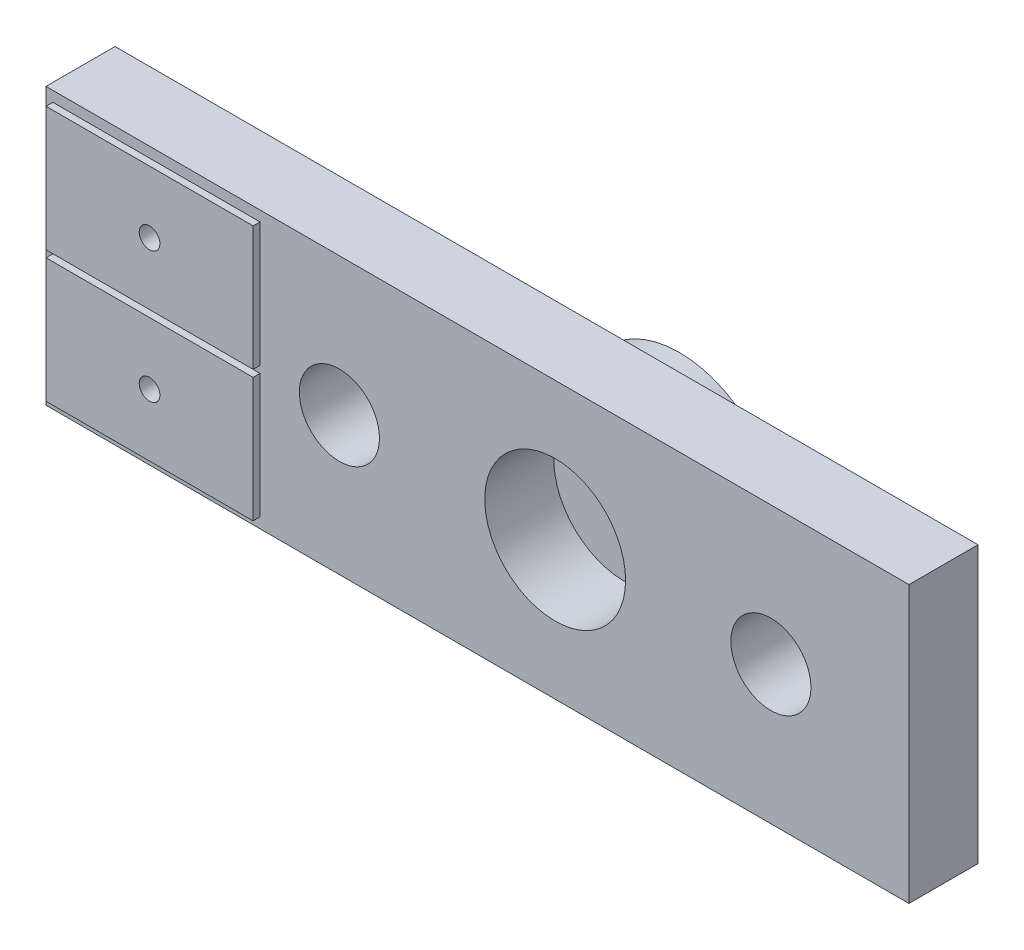
ISO-10303-21;
HEADER;
FILE_DESCRIPTION(('STEP AP214'),'2;1');
FILE_NAME('part.step','',(''),(''),'','','');
FILE_SCHEMA(('AUTOMOTIVE_DESIGN { 1 0 10303 214 1 1 1 1 }'));
ENDSEC;
DATA;
#1=APPLICATION_CONTEXT('core data for automotive mechanical design processes');
#2=APPLICATION_PROTOCOL_DEFINITION('international standard','automotive_design',2000,#1);
#3=PRODUCT_CONTEXT('',#1,'mechanical');
#4=PRODUCT('Part','Part','',(#3));
#5=PRODUCT_RELATED_PRODUCT_CATEGORY('part','',(#4));
#6=PRODUCT_DEFINITION_FORMATION('','',#4);
#7=PRODUCT_DEFINITION_CONTEXT('part definition',#1,'design');
#8=PRODUCT_DEFINITION('design','',#6,#7);
#9=PRODUCT_DEFINITION_SHAPE('','',#8);
#10=(LENGTH_UNIT() NAMED_UNIT(*) SI_UNIT(.MILLI.,.METRE.));
#11=(NAMED_UNIT(*) PLANE_ANGLE_UNIT() SI_UNIT($,.RADIAN.));
#12=(NAMED_UNIT(*) SI_UNIT($,.STERADIAN.) SOLID_ANGLE_UNIT());
#13=UNCERTAINTY_MEASURE_WITH_UNIT(LENGTH_MEASURE(1.E-05),#10,'distance_accuracy_value','');
#14=(GEOMETRIC_REPRESENTATION_CONTEXT(3) GLOBAL_UNCERTAINTY_ASSIGNED_CONTEXT((#13)) GLOBAL_UNIT_ASSIGNED_CONTEXT((#10,
#11,#12)) REPRESENTATION_CONTEXT('',''));
#15=CARTESIAN_POINT('',(0.,0.,0.));
#16=DIRECTION('',(0.,0.,1.));
#17=DIRECTION('',(1.,0.,0.));
#18=AXIS2_PLACEMENT_3D('',#15,#16,#17);
#19=CARTESIAN_POINT('',(0.,0.,2.54));
#20=DIRECTION('',(0.,0.,1.));
#21=DIRECTION('',(1.,0.,0.));
#22=AXIS2_PLACEMENT_3D('',#19,#20,#21);
#23=PLANE('',#22);
#24=CARTESIAN_POINT('',(2.47650000000001,0.,2.54));
#25=DIRECTION('',(0.,0.,1.));
#26=DIRECTION('',(1.,0.,0.));
#27=AXIS2_PLACEMENT_3D('',#24,#25,#26);
#28=CIRCLE('',#27,2.5908);
#29=CARTESIAN_POINT('',(5.06730000000001,0.,2.54));
#30=VERTEX_POINT('',#29);
#31=EDGE_CURVE('E201',#30,#30,#28,.T.);
#32=ORIENTED_EDGE('',*,*,#31,.F.);
#33=EDGE_LOOP('',(#32));
#34=FACE_BOUND('',#33,.T.);
#35=CARTESIAN_POINT('',(-5.461,0.,2.54));
#36=DIRECTION('',(0.,0.,1.));
#37=DIRECTION('',(1.,0.,0.));
#38=AXIS2_PLACEMENT_3D('',#35,#36,#37);
#39=CIRCLE('',#38,1.4732);
#40=CARTESIAN_POINT('',(-3.9878,0.,2.54));
#41=VERTEX_POINT('',#40);
#42=EDGE_CURVE('E218',#41,#41,#39,.T.);
#43=ORIENTED_EDGE('',*,*,#42,.F.);
#44=EDGE_LOOP('',(#43));
#45=FACE_BOUND('',#44,.T.);
#46=DIRECTION('',(0.,1.,0.));
#47=VECTOR('',#46,1.);
#48=CARTESIAN_POINT('',(15.494,5.08,2.54));
#49=LINE('',#48,#47);
#50=CARTESIAN_POINT('',(15.494,-5.08,2.54));
#51=VERTEX_POINT('',#50);
#52=CARTESIAN_POINT('',(15.494,5.08,2.54));
#53=VERTEX_POINT('',#52);
#54=EDGE_CURVE('E226',#51,#53,#49,.T.);
#55=ORIENTED_EDGE('',*,*,#54,.T.);
#56=DIRECTION('',(-1.,0.,0.));
#57=VECTOR('',#56,1.);
#58=CARTESIAN_POINT('',(-16.256,5.08,2.54));
#59=LINE('',#58,#57);
#60=CARTESIAN_POINT('',(-16.256,5.08,2.54));
#61=VERTEX_POINT('',#60);
#62=EDGE_CURVE('E230',#53,#61,#59,.T.);
#63=ORIENTED_EDGE('',*,*,#62,.T.);
#64=DIRECTION('',(0.,-1.,0.));
#65=VECTOR('',#64,1.);
#66=CARTESIAN_POINT('',(-16.256,5.08,2.54));
#67=LINE('',#66,#65);
#68=CARTESIAN_POINT('',(-16.256,-5.08,2.54));
#69=VERTEX_POINT('',#68);
#70=EDGE_CURVE('E234',#61,#69,#67,.T.);
#71=ORIENTED_EDGE('',*,*,#70,.T.);
#72=DIRECTION('',(1.,0.,0.));
#73=VECTOR('',#72,1.);
#74=CARTESIAN_POINT('',(-16.256,-5.08,2.54));
#75=LINE('',#74,#73);
#76=EDGE_CURVE('E237',#69,#51,#75,.T.);
#77=ORIENTED_EDGE('',*,*,#76,.T.);
#78=EDGE_LOOP('',(#55,#63,#71,#77));
#79=FACE_BOUND('',#78,.T.);
#80=CARTESIAN_POINT('',(10.414,0.,2.54));
#81=DIRECTION('',(0.,0.,1.));
#82=DIRECTION('',(-1.,0.,0.));
#83=AXIS2_PLACEMENT_3D('',#80,#81,#82);
#84=CIRCLE('',#83,1.4732);
#85=CARTESIAN_POINT('',(8.9408,0.,2.54));
#86=VERTEX_POINT('',#85);
#87=EDGE_CURVE('E210',#86,#86,#84,.T.);
#88=ORIENTED_EDGE('',*,*,#87,.F.);
#89=EDGE_LOOP('',(#88));
#90=FACE_BOUND('',#89,.T.);
#91=DIRECTION('',(1.,0.,0.));
#92=VECTOR('',#91,1.);
#93=CARTESIAN_POINT('',(-16.002,0.127000000000001,2.54));
#94=LINE('',#93,#92);
#95=CARTESIAN_POINT('',(-16.002,0.127000000000001,2.54));
#96=VERTEX_POINT('',#95);
#97=CARTESIAN_POINT('',(-8.382,0.127000000000001,2.54));
#98=VERTEX_POINT('',#97);
#99=EDGE_CURVE('E162',#96,#98,#94,.T.);
#100=ORIENTED_EDGE('',*,*,#99,.F.);
#101=DIRECTION('',(0.,-1.,0.));
#102=VECTOR('',#101,1.);
#103=CARTESIAN_POINT('',(-16.002,4.699,2.54));
#104=LINE('',#103,#102);
#105=CARTESIAN_POINT('',(-16.002,4.699,2.54));
#106=VERTEX_POINT('',#105);
#107=EDGE_CURVE('E157',#106,#96,#104,.T.);
#108=ORIENTED_EDGE('',*,*,#107,.F.);
#109=DIRECTION('',(-1.,0.,0.));
#110=VECTOR('',#109,1.);
#111=CARTESIAN_POINT('',(-16.002,4.699,2.54));
#112=LINE('',#111,#110);
#113=CARTESIAN_POINT('',(-8.382,4.699,2.54));
#114=VERTEX_POINT('',#113);
#115=EDGE_CURVE('E172',#114,#106,#112,.T.);
#116=ORIENTED_EDGE('',*,*,#115,.F.);
#117=DIRECTION('',(0.,1.,0.));
#118=VECTOR('',#117,1.);
#119=CARTESIAN_POINT('',(-8.382,4.699,2.54));
#120=LINE('',#119,#118);
#121=EDGE_CURVE('E184',#98,#114,#120,.T.);
#122=ORIENTED_EDGE('',*,*,#121,.F.);
#123=EDGE_LOOP('',(#100,#108,#116,#122));
#124=FACE_BOUND('',#123,.T.);
#125=DIRECTION('',(0.,1.,0.));
#126=VECTOR('',#125,1.);
#127=CARTESIAN_POINT('',(-8.382,-4.699,2.54));
#128=LINE('',#127,#126);
#129=CARTESIAN_POINT('',(-8.382,-4.699,2.54));
#130=VERTEX_POINT('',#129);
#131=CARTESIAN_POINT('',(-8.382,-0.127000000000001,2.54));
#132=VERTEX_POINT('',#131);
#133=EDGE_CURVE('E296',#130,#132,#128,.T.);
#134=ORIENTED_EDGE('',*,*,#133,.F.);
#135=DIRECTION('',(1.,0.,0.));
#136=VECTOR('',#135,1.);
#137=CARTESIAN_POINT('',(-16.002,-4.699,2.54));
#138=LINE('',#137,#136);
#139=CARTESIAN_POINT('',(-16.002,-4.699,2.54));
#140=VERTEX_POINT('',#139);
#141=EDGE_CURVE('E154',#140,#130,#138,.T.);
#142=ORIENTED_EDGE('',*,*,#141,.F.);
#143=DIRECTION('',(0.,-1.,0.));
#144=VECTOR('',#143,1.);
#145=CARTESIAN_POINT('',(-16.002,-4.699,2.54));
#146=LINE('',#145,#144);
#147=CARTESIAN_POINT('',(-16.002,-0.127000000000001,2.54));
#148=VERTEX_POINT('',#147);
#149=EDGE_CURVE('E150',#148,#140,#146,.T.);
#150=ORIENTED_EDGE('',*,*,#149,.F.);
#151=DIRECTION('',(-1.,0.,0.));
#152=VECTOR('',#151,1.);
#153=CARTESIAN_POINT('',(-16.002,-0.127000000000001,2.54));
#154=LINE('',#153,#152);
#155=EDGE_CURVE('E298',#132,#148,#154,.T.);
#156=ORIENTED_EDGE('',*,*,#155,.F.);
#157=EDGE_LOOP('',(#134,#142,#150,#156));
#158=FACE_BOUND('',#157,.T.);
#159=ADVANCED_FACE('F38',(#34,#45,#79,#90,#124,#158),#23,.T.);
#160=CARTESIAN_POINT('',(0.,0.,0.));
#161=DIRECTION('',(0.,0.,1.));
#162=DIRECTION('',(1.,0.,0.));
#163=AXIS2_PLACEMENT_3D('',#160,#161,#162);
#164=PLANE('',#163);
#165=CARTESIAN_POINT('',(2.47650000000001,0.,0.));
#166=DIRECTION('',(0.,0.,1.));
#167=DIRECTION('',(1.,0.,0.));
#168=AXIS2_PLACEMENT_3D('',#165,#166,#167);
#169=CIRCLE('',#168,3.683);
#170=CARTESIAN_POINT('',(6.15950000000001,0.,0.));
#171=VERTEX_POINT('',#170);
#172=EDGE_CURVE('E11',#171,#171,#169,.F.);
#173=ORIENTED_EDGE('',*,*,#172,.F.);
#174=EDGE_LOOP('',(#173));
#175=FACE_BOUND('',#174,.T.);
#176=CARTESIAN_POINT('',(-12.192,2.413,0.));
#177=DIRECTION('',(0.,0.,1.));
#178=DIRECTION('',(1.,0.,0.));
#179=AXIS2_PLACEMENT_3D('',#176,#177,#178);
#180=CIRCLE('',#179,0.381);
#181=CARTESIAN_POINT('',(-11.811,2.413,0.));
#182=VERTEX_POINT('',#181);
#183=EDGE_CURVE('E304',#182,#182,#180,.T.);
#184=ORIENTED_EDGE('',*,*,#183,.T.);
#185=EDGE_LOOP('',(#184));
#186=FACE_BOUND('',#185,.T.);
#187=CARTESIAN_POINT('',(-12.192,-2.413,0.));
#188=DIRECTION('',(0.,0.,1.));
#189=DIRECTION('',(-1.,0.,0.));
#190=AXIS2_PLACEMENT_3D('',#187,#188,#189);
#191=CIRCLE('',#190,0.381);
#192=CARTESIAN_POINT('',(-12.573,-2.413,0.));
#193=VERTEX_POINT('',#192);
#194=EDGE_CURVE('E321',#193,#193,#191,.T.);
#195=ORIENTED_EDGE('',*,*,#194,.T.);
#196=EDGE_LOOP('',(#195));
#197=FACE_BOUND('',#196,.T.);
#198=DIRECTION('',(0.,1.,0.));
#199=VECTOR('',#198,1.);
#200=CARTESIAN_POINT('',(15.494,5.08,0.));
#201=LINE('',#200,#199);
#202=CARTESIAN_POINT('',(15.494,-5.08,0.));
#203=VERTEX_POINT('',#202);
#204=CARTESIAN_POINT('',(15.494,5.08,0.));
#205=VERTEX_POINT('',#204);
#206=EDGE_CURVE('E222',#203,#205,#201,.T.);
#207=ORIENTED_EDGE('',*,*,#206,.F.);
#208=DIRECTION('',(1.,0.,0.));
#209=VECTOR('',#208,1.);
#210=CARTESIAN_POINT('',(-16.256,-5.08,0.));
#211=LINE('',#210,#209);
#212=CARTESIAN_POINT('',(-16.256,-5.08,0.));
#213=VERTEX_POINT('',#212);
#214=EDGE_CURVE('E231',#213,#203,#211,.T.);
#215=ORIENTED_EDGE('',*,*,#214,.F.);
#216=DIRECTION('',(0.,-1.,0.));
#217=VECTOR('',#216,1.);
#218=CARTESIAN_POINT('',(-16.256,5.08,0.));
#219=LINE('',#218,#217);
#220=CARTESIAN_POINT('',(-16.256,5.08,0.));
#221=VERTEX_POINT('',#220);
#222=EDGE_CURVE('E247',#221,#213,#219,.T.);
#223=ORIENTED_EDGE('',*,*,#222,.F.);
#224=DIRECTION('',(-1.,0.,0.));
#225=VECTOR('',#224,1.);
#226=CARTESIAN_POINT('',(-16.256,5.08,0.));
#227=LINE('',#226,#225);
#228=EDGE_CURVE('E244',#205,#221,#227,.T.);
#229=ORIENTED_EDGE('',*,*,#228,.F.);
#230=EDGE_LOOP('',(#207,#215,#223,#229));
#231=FACE_BOUND('',#230,.T.);
#232=CARTESIAN_POINT('',(-5.461,0.,0.));
#233=DIRECTION('',(0.,0.,1.));
#234=DIRECTION('',(1.,0.,0.));
#235=AXIS2_PLACEMENT_3D('',#232,#233,#234);
#236=CIRCLE('',#235,1.4732);
#237=CARTESIAN_POINT('',(-3.9878,0.,0.));
#238=VERTEX_POINT('',#237);
#239=EDGE_CURVE('E214',#238,#238,#236,.T.);
#240=ORIENTED_EDGE('',*,*,#239,.T.);
#241=EDGE_LOOP('',(#240));
#242=FACE_BOUND('',#241,.T.);
#243=CARTESIAN_POINT('',(10.414,0.,0.));
#244=DIRECTION('',(0.,0.,1.));
#245=DIRECTION('',(-1.,0.,0.));
#246=AXIS2_PLACEMENT_3D('',#243,#244,#245);
#247=CIRCLE('',#246,1.4732);
#248=CARTESIAN_POINT('',(8.9408,0.,0.));
#249=VERTEX_POINT('',#248);
#250=EDGE_CURVE('E209',#249,#249,#247,.T.);
#251=ORIENTED_EDGE('',*,*,#250,.T.);
#252=EDGE_LOOP('',(#251));
#253=FACE_BOUND('',#252,.T.);
#254=ADVANCED_FACE('F274',(#175,#186,#197,#231,#242,#253),#164,.F.);
#255=CARTESIAN_POINT('',(15.494,5.08,2.54));
#256=DIRECTION('',(-1.,0.,0.));
#257=DIRECTION('',(0.,0.,1.));
#258=AXIS2_PLACEMENT_3D('',#255,#256,#257);
#259=PLANE('',#258);
#260=ORIENTED_EDGE('',*,*,#206,.T.);
#261=DIRECTION('',(0.,0.,-1.));
#262=VECTOR('',#261,1.);
#263=CARTESIAN_POINT('',(15.494,5.08,2.54));
#264=LINE('',#263,#262);
#265=EDGE_CURVE('E47',#53,#205,#264,.T.);
#266=ORIENTED_EDGE('',*,*,#265,.F.);
#267=ORIENTED_EDGE('',*,*,#54,.F.);
#268=DIRECTION('',(0.,0.,-1.));
#269=VECTOR('',#268,1.);
#270=CARTESIAN_POINT('',(15.494,-5.08,2.54));
#271=LINE('',#270,#269);
#272=EDGE_CURVE('E240',#51,#203,#271,.T.);
#273=ORIENTED_EDGE('',*,*,#272,.T.);
#274=EDGE_LOOP('',(#260,#266,#267,#273));
#275=FACE_BOUND('',#274,.T.);
#276=ADVANCED_FACE('F40',(#275),#259,.F.);
#277=CARTESIAN_POINT('',(-16.256,5.08,2.54));
#278=DIRECTION('',(0.,-1.,0.));
#279=DIRECTION('',(0.,0.,-1.));
#280=AXIS2_PLACEMENT_3D('',#277,#278,#279);
#281=PLANE('',#280);
#282=ORIENTED_EDGE('',*,*,#228,.T.);
#283=DIRECTION('',(0.,0.,-1.));
#284=VECTOR('',#283,1.);
#285=CARTESIAN_POINT('',(-16.256,5.08,2.54));
#286=LINE('',#285,#284);
#287=EDGE_CURVE('E259',#61,#221,#286,.T.);
#288=ORIENTED_EDGE('',*,*,#287,.F.);
#289=ORIENTED_EDGE('',*,*,#62,.F.);
#290=ORIENTED_EDGE('',*,*,#265,.T.);
#291=EDGE_LOOP('',(#282,#288,#289,#290));
#292=FACE_BOUND('',#291,.T.);
#293=ADVANCED_FACE('F266',(#292),#281,.F.);
#294=CARTESIAN_POINT('',(-16.256,5.08,2.54));
#295=DIRECTION('',(1.,0.,0.));
#296=DIRECTION('',(0.,1.,0.));
#297=AXIS2_PLACEMENT_3D('',#294,#295,#296);
#298=PLANE('',#297);
#299=ORIENTED_EDGE('',*,*,#222,.T.);
#300=DIRECTION('',(0.,0.,-1.));
#301=VECTOR('',#300,1.);
#302=CARTESIAN_POINT('',(-16.256,-5.08,2.54));
#303=LINE('',#302,#301);
#304=EDGE_CURVE('E255',#69,#213,#303,.T.);
#305=ORIENTED_EDGE('',*,*,#304,.F.);
#306=ORIENTED_EDGE('',*,*,#70,.F.);
#307=ORIENTED_EDGE('',*,*,#287,.T.);
#308=EDGE_LOOP('',(#299,#305,#306,#307));
#309=FACE_BOUND('',#308,.T.);
#310=ADVANCED_FACE('F279',(#309),#298,.F.);
#311=CARTESIAN_POINT('',(-16.256,-5.08,2.54));
#312=DIRECTION('',(0.,1.,0.));
#313=DIRECTION('',(0.,0.,1.));
#314=AXIS2_PLACEMENT_3D('',#311,#312,#313);
#315=PLANE('',#314);
#316=ORIENTED_EDGE('',*,*,#214,.T.);
#317=ORIENTED_EDGE('',*,*,#272,.F.);
#318=ORIENTED_EDGE('',*,*,#76,.F.);
#319=ORIENTED_EDGE('',*,*,#304,.T.);
#320=EDGE_LOOP('',(#316,#317,#318,#319));
#321=FACE_BOUND('',#320,.T.);
#322=ADVANCED_FACE('F283',(#321),#315,.F.);
#323=CARTESIAN_POINT('',(-5.461,0.,2.54));
#324=DIRECTION('',(0.,0.,-1.));
#325=DIRECTION('',(-1.,0.,0.));
#326=AXIS2_PLACEMENT_3D('',#323,#324,#325);
#327=CYLINDRICAL_SURFACE('',#326,1.4732);
#328=ORIENTED_EDGE('',*,*,#42,.T.);
#329=EDGE_LOOP('',(#328));
#330=FACE_BOUND('',#329,.T.);
#331=ORIENTED_EDGE('',*,*,#239,.F.);
#332=EDGE_LOOP('',(#331));
#333=FACE_BOUND('',#332,.T.);
#334=ADVANCED_FACE('F403',(#330,#333),#327,.F.);
#335=CARTESIAN_POINT('',(10.414,0.,2.54));
#336=DIRECTION('',(0.,0.,-1.));
#337=DIRECTION('',(-1.,0.,0.));
#338=AXIS2_PLACEMENT_3D('',#335,#336,#337);
#339=CYLINDRICAL_SURFACE('',#338,1.4732);
#340=ORIENTED_EDGE('',*,*,#87,.T.);
#341=EDGE_LOOP('',(#340));
#342=FACE_BOUND('',#341,.T.);
#343=ORIENTED_EDGE('',*,*,#250,.F.);
#344=EDGE_LOOP('',(#343));
#345=FACE_BOUND('',#344,.T.);
#346=ADVANCED_FACE('F399',(#342,#345),#339,.F.);
#347=CARTESIAN_POINT('',(2.47650000000001,0.,2.54));
#348=DIRECTION('',(0.,0.,1.));
#349=DIRECTION('',(1.,0.,0.));
#350=AXIS2_PLACEMENT_3D('',#347,#348,#349);
#351=CYLINDRICAL_SURFACE('',#350,2.5908);
#352=CARTESIAN_POINT('',(2.47650000000001,0.,0.));
#353=DIRECTION('',(0.,0.,1.));
#354=DIRECTION('',(1.,0.,0.));
#355=AXIS2_PLACEMENT_3D('',#352,#353,#354);
#356=CIRCLE('',#355,2.5908);
#357=CARTESIAN_POINT('',(5.06730000000001,0.,0.));
#358=VERTEX_POINT('',#357);
#359=EDGE_CURVE('E205',#358,#358,#356,.T.);
#360=ORIENTED_EDGE('',*,*,#359,.F.);
#361=EDGE_LOOP('',(#360));
#362=FACE_BOUND('',#361,.T.);
#363=ORIENTED_EDGE('',*,*,#31,.T.);
#364=EDGE_LOOP('',(#363));
#365=FACE_BOUND('',#364,.T.);
#366=ADVANCED_FACE('F395',(#362,#365),#351,.F.);
#367=CARTESIAN_POINT('',(-16.002,4.699,2.794));
#368=DIRECTION('',(1.,0.,0.));
#369=DIRECTION('',(0.,1.,0.));
#370=AXIS2_PLACEMENT_3D('',#367,#368,#369);
#371=PLANE('',#370);
#372=ORIENTED_EDGE('',*,*,#107,.T.);
#373=DIRECTION('',(0.,0.,-1.));
#374=VECTOR('',#373,1.);
#375=CARTESIAN_POINT('',(-16.002,0.127000000000001,2.794));
#376=LINE('',#375,#374);
#377=CARTESIAN_POINT('',(-16.002,0.127000000000001,2.794));
#378=VERTEX_POINT('',#377);
#379=EDGE_CURVE('E198',#378,#96,#376,.T.);
#380=ORIENTED_EDGE('',*,*,#379,.F.);
#381=DIRECTION('',(0.,-1.,0.));
#382=VECTOR('',#381,1.);
#383=CARTESIAN_POINT('',(-16.002,4.699,2.794));
#384=LINE('',#383,#382);
#385=CARTESIAN_POINT('',(-16.002,4.699,2.794));
#386=VERTEX_POINT('',#385);
#387=EDGE_CURVE('E167',#386,#378,#384,.T.);
#388=ORIENTED_EDGE('',*,*,#387,.F.);
#389=DIRECTION('',(0.,0.,-1.));
#390=VECTOR('',#389,1.);
#391=CARTESIAN_POINT('',(-16.002,4.699,2.794));
#392=LINE('',#391,#390);
#393=EDGE_CURVE('E180',#386,#106,#392,.T.);
#394=ORIENTED_EDGE('',*,*,#393,.T.);
#395=EDGE_LOOP('',(#372,#380,#388,#394));
#396=FACE_BOUND('',#395,.T.);
#397=ADVANCED_FACE('F391',(#396),#371,.F.);
#398=CARTESIAN_POINT('',(-16.002,0.127000000000001,2.794));
#399=DIRECTION('',(0.,1.,0.));
#400=DIRECTION('',(-1.,0.,0.));
#401=AXIS2_PLACEMENT_3D('',#398,#399,#400);
#402=PLANE('',#401);
#403=ORIENTED_EDGE('',*,*,#99,.T.);
#404=DIRECTION('',(0.,0.,-1.));
#405=VECTOR('',#404,1.);
#406=CARTESIAN_POINT('',(-8.382,0.127000000000001,2.794));
#407=LINE('',#406,#405);
#408=CARTESIAN_POINT('',(-8.382,0.127000000000001,2.794));
#409=VERTEX_POINT('',#408);
#410=EDGE_CURVE('E194',#409,#98,#407,.T.);
#411=ORIENTED_EDGE('',*,*,#410,.F.);
#412=DIRECTION('',(1.,0.,0.));
#413=VECTOR('',#412,1.);
#414=CARTESIAN_POINT('',(-16.002,0.127000000000001,2.794));
#415=LINE('',#414,#413);
#416=EDGE_CURVE('E171',#378,#409,#415,.T.);
#417=ORIENTED_EDGE('',*,*,#416,.F.);
#418=ORIENTED_EDGE('',*,*,#379,.T.);
#419=EDGE_LOOP('',(#403,#411,#417,#418));
#420=FACE_BOUND('',#419,.T.);
#421=ADVANCED_FACE('F387',(#420),#402,.F.);
#422=CARTESIAN_POINT('',(-8.382,4.699,2.794));
#423=DIRECTION('',(-1.,0.,0.));
#424=DIRECTION('',(0.,0.,1.));
#425=AXIS2_PLACEMENT_3D('',#422,#423,#424);
#426=PLANE('',#425);
#427=ORIENTED_EDGE('',*,*,#121,.T.);
#428=DIRECTION('',(0.,0.,-1.));
#429=VECTOR('',#428,1.);
#430=CARTESIAN_POINT('',(-8.382,4.699,2.794));
#431=LINE('',#430,#429);
#432=CARTESIAN_POINT('',(-8.382,4.699,2.794));
#433=VERTEX_POINT('',#432);
#434=EDGE_CURVE('E62',#433,#114,#431,.T.);
#435=ORIENTED_EDGE('',*,*,#434,.F.);
#436=DIRECTION('',(0.,1.,0.));
#437=VECTOR('',#436,1.);
#438=CARTESIAN_POINT('',(-8.382,4.699,2.794));
#439=LINE('',#438,#437);
#440=EDGE_CURVE('E175',#409,#433,#439,.T.);
#441=ORIENTED_EDGE('',*,*,#440,.F.);
#442=ORIENTED_EDGE('',*,*,#410,.T.);
#443=EDGE_LOOP('',(#427,#435,#441,#442));
#444=FACE_BOUND('',#443,.T.);
#445=ADVANCED_FACE('F384',(#444),#426,.F.);
#446=CARTESIAN_POINT('',(-16.002,4.699,2.794));
#447=DIRECTION('',(0.,-1.,0.));
#448=DIRECTION('',(0.,0.,-1.));
#449=AXIS2_PLACEMENT_3D('',#446,#447,#448);
#450=PLANE('',#449);
#451=ORIENTED_EDGE('',*,*,#115,.T.);
#452=ORIENTED_EDGE('',*,*,#393,.F.);
#453=DIRECTION('',(-1.,0.,0.));
#454=VECTOR('',#453,1.);
#455=CARTESIAN_POINT('',(-16.002,4.699,2.794));
#456=LINE('',#455,#454);
#457=EDGE_CURVE('E178',#433,#386,#456,.T.);
#458=ORIENTED_EDGE('',*,*,#457,.F.);
#459=ORIENTED_EDGE('',*,*,#434,.T.);
#460=EDGE_LOOP('',(#451,#452,#458,#459));
#461=FACE_BOUND('',#460,.T.);
#462=ADVANCED_FACE('F380',(#461),#450,.F.);
#463=CARTESIAN_POINT('',(0.,0.,2.794));
#464=DIRECTION('',(0.,0.,1.));
#465=DIRECTION('',(1.,0.,0.));
#466=AXIS2_PLACEMENT_3D('',#463,#464,#465);
#467=PLANE('',#466);
#468=CARTESIAN_POINT('',(-12.192,2.413,2.794));
#469=DIRECTION('',(0.,0.,1.));
#470=DIRECTION('',(1.,0.,0.));
#471=AXIS2_PLACEMENT_3D('',#468,#469,#470);
#472=CIRCLE('',#471,0.381);
#473=CARTESIAN_POINT('',(-11.811,2.413,2.794));
#474=VERTEX_POINT('',#473);
#475=EDGE_CURVE('E326',#474,#474,#472,.T.);
#476=ORIENTED_EDGE('',*,*,#475,.F.);
#477=EDGE_LOOP('',(#476));
#478=FACE_BOUND('',#477,.T.);
#479=ORIENTED_EDGE('',*,*,#387,.T.);
#480=ORIENTED_EDGE('',*,*,#416,.T.);
#481=ORIENTED_EDGE('',*,*,#440,.T.);
#482=ORIENTED_EDGE('',*,*,#457,.T.);
#483=EDGE_LOOP('',(#479,#480,#481,#482));
#484=FACE_BOUND('',#483,.T.);
#485=ADVANCED_FACE('F377',(#478,#484),#467,.T.);
#486=CARTESIAN_POINT('',(-16.002,-4.699,2.794));
#487=DIRECTION('',(0.,1.,0.));
#488=DIRECTION('',(0.,0.,1.));
#489=AXIS2_PLACEMENT_3D('',#486,#487,#488);
#490=PLANE('',#489);
#491=ORIENTED_EDGE('',*,*,#141,.T.);
#492=DIRECTION('',(0.,0.,-1.));
#493=VECTOR('',#492,1.);
#494=CARTESIAN_POINT('',(-8.382,-4.699,2.794));
#495=LINE('',#494,#493);
#496=CARTESIAN_POINT('',(-8.382,-4.699,2.794));
#497=VERTEX_POINT('',#496);
#498=EDGE_CURVE('E133',#497,#130,#495,.T.);
#499=ORIENTED_EDGE('',*,*,#498,.F.);
#500=DIRECTION('',(1.,0.,0.));
#501=VECTOR('',#500,1.);
#502=CARTESIAN_POINT('',(-16.002,-4.699,2.794));
#503=LINE('',#502,#501);
#504=CARTESIAN_POINT('',(-16.002,-4.699,2.794));
#505=VERTEX_POINT('',#504);
#506=EDGE_CURVE('E141',#505,#497,#503,.T.);
#507=ORIENTED_EDGE('',*,*,#506,.F.);
#508=DIRECTION('',(0.,0.,-1.));
#509=VECTOR('',#508,1.);
#510=CARTESIAN_POINT('',(-16.002,-4.699,2.794));
#511=LINE('',#510,#509);
#512=EDGE_CURVE('E310',#505,#140,#511,.T.);
#513=ORIENTED_EDGE('',*,*,#512,.T.);
#514=EDGE_LOOP('',(#491,#499,#507,#513));
#515=FACE_BOUND('',#514,.T.);
#516=ADVANCED_FACE('F152',(#515),#490,.F.);
#517=CARTESIAN_POINT('',(-8.382,-4.699,2.794));
#518=DIRECTION('',(-1.,0.,0.));
#519=DIRECTION('',(0.,0.,1.));
#520=AXIS2_PLACEMENT_3D('',#517,#518,#519);
#521=PLANE('',#520);
#522=ORIENTED_EDGE('',*,*,#133,.T.);
#523=DIRECTION('',(0.,0.,-1.));
#524=VECTOR('',#523,1.);
#525=CARTESIAN_POINT('',(-8.382,-0.127000000000001,2.794));
#526=LINE('',#525,#524);
#527=CARTESIAN_POINT('',(-8.382,-0.127000000000001,2.794));
#528=VERTEX_POINT('',#527);
#529=EDGE_CURVE('E136',#528,#132,#526,.T.);
#530=ORIENTED_EDGE('',*,*,#529,.F.);
#531=DIRECTION('',(0.,1.,0.));
#532=VECTOR('',#531,1.);
#533=CARTESIAN_POINT('',(-8.382,-4.699,2.794));
#534=LINE('',#533,#532);
#535=EDGE_CURVE('E129',#497,#528,#534,.T.);
#536=ORIENTED_EDGE('',*,*,#535,.F.);
#537=ORIENTED_EDGE('',*,*,#498,.T.);
#538=EDGE_LOOP('',(#522,#530,#536,#537));
#539=FACE_BOUND('',#538,.T.);
#540=ADVANCED_FACE('F131',(#539),#521,.F.);
#541=CARTESIAN_POINT('',(-16.002,-0.127000000000001,2.794));
#542=DIRECTION('',(0.,-1.,0.));
#543=DIRECTION('',(1.,0.,0.));
#544=AXIS2_PLACEMENT_3D('',#541,#542,#543);
#545=PLANE('',#544);
#546=ORIENTED_EDGE('',*,*,#155,.T.);
#547=DIRECTION('',(0.,0.,-1.));
#548=VECTOR('',#547,1.);
#549=CARTESIAN_POINT('',(-16.002,-0.127000000000001,2.794));
#550=LINE('',#549,#548);
#551=CARTESIAN_POINT('',(-16.002,-0.127000000000001,2.794));
#552=VERTEX_POINT('',#551);
#553=EDGE_CURVE('E54',#552,#148,#550,.T.);
#554=ORIENTED_EDGE('',*,*,#553,.F.);
#555=DIRECTION('',(-1.,0.,0.));
#556=VECTOR('',#555,1.);
#557=CARTESIAN_POINT('',(-16.002,-0.127000000000001,2.794));
#558=LINE('',#557,#556);
#559=EDGE_CURVE('E140',#528,#552,#558,.T.);
#560=ORIENTED_EDGE('',*,*,#559,.F.);
#561=ORIENTED_EDGE('',*,*,#529,.T.);
#562=EDGE_LOOP('',(#546,#554,#560,#561));
#563=FACE_BOUND('',#562,.T.);
#564=ADVANCED_FACE('F366',(#563),#545,.F.);
#565=CARTESIAN_POINT('',(-16.002,-4.699,2.794));
#566=DIRECTION('',(1.,0.,0.));
#567=DIRECTION('',(0.,1.,0.));
#568=AXIS2_PLACEMENT_3D('',#565,#566,#567);
#569=PLANE('',#568);
#570=ORIENTED_EDGE('',*,*,#149,.T.);
#571=ORIENTED_EDGE('',*,*,#512,.F.);
#572=DIRECTION('',(0.,-1.,0.));
#573=VECTOR('',#572,1.);
#574=CARTESIAN_POINT('',(-16.002,-4.699,2.794));
#575=LINE('',#574,#573);
#576=EDGE_CURVE('E145',#552,#505,#575,.T.);
#577=ORIENTED_EDGE('',*,*,#576,.F.);
#578=ORIENTED_EDGE('',*,*,#553,.T.);
#579=EDGE_LOOP('',(#570,#571,#577,#578));
#580=FACE_BOUND('',#579,.T.);
#581=ADVANCED_FACE('F361',(#580),#569,.F.);
#582=CARTESIAN_POINT('',(0.,0.,2.794));
#583=DIRECTION('',(0.,0.,1.));
#584=DIRECTION('',(1.,0.,0.));
#585=AXIS2_PLACEMENT_3D('',#582,#583,#584);
#586=PLANE('',#585);
#587=CARTESIAN_POINT('',(-12.192,-2.413,2.794));
#588=DIRECTION('',(0.,0.,1.));
#589=DIRECTION('',(-1.,0.,0.));
#590=AXIS2_PLACEMENT_3D('',#587,#588,#589);
#591=CIRCLE('',#590,0.381);
#592=CARTESIAN_POINT('',(-12.573,-2.413,2.794));
#593=VERTEX_POINT('',#592);
#594=EDGE_CURVE('E317',#593,#593,#591,.T.);
#595=ORIENTED_EDGE('',*,*,#594,.F.);
#596=EDGE_LOOP('',(#595));
#597=FACE_BOUND('',#596,.T.);
#598=ORIENTED_EDGE('',*,*,#506,.T.);
#599=ORIENTED_EDGE('',*,*,#535,.T.);
#600=ORIENTED_EDGE('',*,*,#559,.T.);
#601=ORIENTED_EDGE('',*,*,#576,.T.);
#602=EDGE_LOOP('',(#598,#599,#600,#601));
#603=FACE_BOUND('',#602,.T.);
#604=ADVANCED_FACE('F144',(#597,#603),#586,.T.);
#605=CARTESIAN_POINT('',(-12.192,-2.413,0.));
#606=DIRECTION('',(0.,0.,1.));
#607=DIRECTION('',(1.,0.,0.));
#608=AXIS2_PLACEMENT_3D('',#605,#606,#607);
#609=CYLINDRICAL_SURFACE('',#608,0.381);
#610=ORIENTED_EDGE('',*,*,#194,.F.);
#611=EDGE_LOOP('',(#610));
#612=FACE_BOUND('',#611,.T.);
#613=ORIENTED_EDGE('',*,*,#594,.T.);
#614=EDGE_LOOP('',(#613));
#615=FACE_BOUND('',#614,.T.);
#616=ADVANCED_FACE('F353',(#612,#615),#609,.F.);
#617=CARTESIAN_POINT('',(-12.192,2.413,0.));
#618=DIRECTION('',(0.,0.,1.));
#619=DIRECTION('',(1.,0.,0.));
#620=AXIS2_PLACEMENT_3D('',#617,#618,#619);
#621=CYLINDRICAL_SURFACE('',#620,0.381);
#622=ORIENTED_EDGE('',*,*,#183,.F.);
#623=EDGE_LOOP('',(#622));
#624=FACE_BOUND('',#623,.T.);
#625=ORIENTED_EDGE('',*,*,#475,.T.);
#626=EDGE_LOOP('',(#625));
#627=FACE_BOUND('',#626,.T.);
#628=ADVANCED_FACE('F356',(#624,#627),#621,.F.);
#629=CARTESIAN_POINT('',(2.47650000000001,0.,0.));
#630=DIRECTION('',(0.,0.,-1.));
#631=DIRECTION('',(-1.,0.,0.));
#632=AXIS2_PLACEMENT_3D('',#629,#630,#631);
#633=PLANE('',#632);
#634=ORIENTED_EDGE('',*,*,#359,.T.);
#635=EDGE_LOOP('',(#634));
#636=FACE_BOUND('',#635,.T.);
#637=ADVANCED_FACE('F342',(#636),#633,.F.);
#638=CARTESIAN_POINT('',(2.47650000000001,0.,-2.032));
#639=DIRECTION('',(0.,0.,1.));
#640=DIRECTION('',(1.,0.,0.));
#641=AXIS2_PLACEMENT_3D('',#638,#639,#640);
#642=CYLINDRICAL_SURFACE('',#641,3.683);
#643=CARTESIAN_POINT('',(2.47650000000001,0.,-2.032));
#644=DIRECTION('',(0.,0.,-1.));
#645=DIRECTION('',(-1.,0.,0.));
#646=AXIS2_PLACEMENT_3D('',#643,#644,#645);
#647=CIRCLE('',#646,3.683);
#648=CARTESIAN_POINT('',(-1.20649999999999,0.,-2.032));
#649=VERTEX_POINT('',#648);
#650=EDGE_CURVE('E322',#649,#649,#647,.T.);
#651=ORIENTED_EDGE('',*,*,#650,.F.);
#652=EDGE_LOOP('',(#651));
#653=FACE_BOUND('',#652,.T.);
#654=ORIENTED_EDGE('',*,*,#172,.T.);
#655=EDGE_LOOP('',(#654));
#656=FACE_BOUND('',#655,.T.);
#657=ADVANCED_FACE('F339',(#653,#656),#642,.T.);
#658=CARTESIAN_POINT('',(2.47650000000001,0.,-2.032));
#659=DIRECTION('',(0.,0.,-1.));
#660=DIRECTION('',(-1.,0.,0.));
#661=AXIS2_PLACEMENT_3D('',#658,#659,#660);
#662=PLANE('',#661);
#663=ORIENTED_EDGE('',*,*,#650,.T.);
#664=EDGE_LOOP('',(#663));
#665=FACE_BOUND('',#664,.T.);
#666=ADVANCED_FACE('F337',(#665),#662,.T.);
#667=CLOSED_SHELL('',(#159,#254,#276,#293,#310,#322,#334,#346,#366,#397,#421,#445,#462,#485,
#516,#540,#564,#581,#604,#616,#628,#637,#657,#666));
#668=MANIFOLD_SOLID_BREP('B2',#667);
#669=ADVANCED_BREP_SHAPE_REPRESENTATION('',(#18,#668),#14);
#670=SHAPE_DEFINITION_REPRESENTATION(#9,#669);
ENDSEC;
END-ISO-10303-21;
